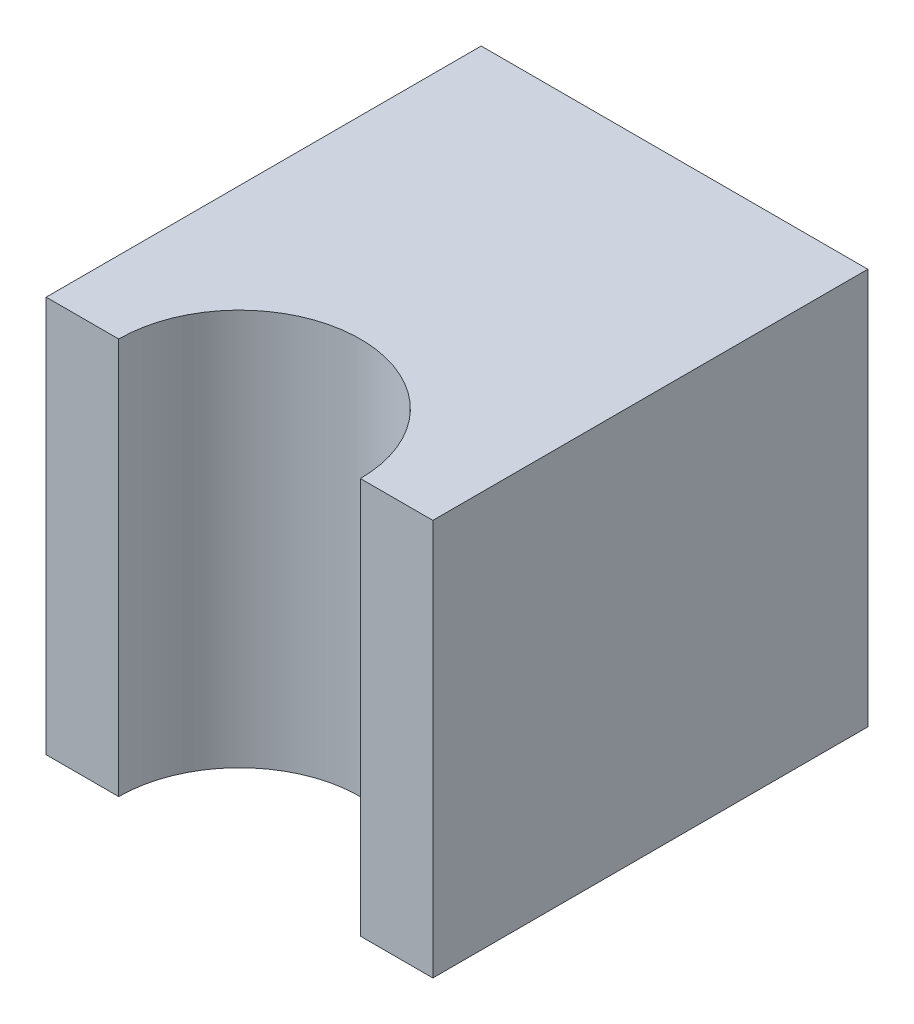
ISO-10303-21;
HEADER;
FILE_DESCRIPTION(('STEP AP214'),'2;1');
FILE_NAME('part.step','',(''),(''),'','','');
FILE_SCHEMA(('AUTOMOTIVE_DESIGN { 1 0 10303 214 1 1 1 1 }'));
ENDSEC;
DATA;
#1=APPLICATION_CONTEXT('core data for automotive mechanical design processes');
#2=APPLICATION_PROTOCOL_DEFINITION('international standard','automotive_design',2000,#1);
#3=PRODUCT_CONTEXT('',#1,'mechanical');
#4=PRODUCT('Part','Part','',(#3));
#5=PRODUCT_RELATED_PRODUCT_CATEGORY('part','',(#4));
#6=PRODUCT_DEFINITION_FORMATION('','',#4);
#7=PRODUCT_DEFINITION_CONTEXT('part definition',#1,'design');
#8=PRODUCT_DEFINITION('design','',#6,#7);
#9=PRODUCT_DEFINITION_SHAPE('','',#8);
#10=(LENGTH_UNIT() NAMED_UNIT(*) SI_UNIT(.MILLI.,.METRE.));
#11=(NAMED_UNIT(*) PLANE_ANGLE_UNIT() SI_UNIT($,.RADIAN.));
#12=(NAMED_UNIT(*) SI_UNIT($,.STERADIAN.) SOLID_ANGLE_UNIT());
#13=UNCERTAINTY_MEASURE_WITH_UNIT(LENGTH_MEASURE(1.E-05),#10,'distance_accuracy_value','');
#14=(GEOMETRIC_REPRESENTATION_CONTEXT(3) GLOBAL_UNCERTAINTY_ASSIGNED_CONTEXT((#13)) GLOBAL_UNIT_ASSIGNED_CONTEXT((#10,
#11,#12)) REPRESENTATION_CONTEXT('',''));
#15=CARTESIAN_POINT('',(0.,0.,0.));
#16=DIRECTION('',(0.,0.,1.));
#17=DIRECTION('',(1.,0.,0.));
#18=AXIS2_PLACEMENT_3D('',#15,#16,#17);
#19=CARTESIAN_POINT('',(7.,0.,6.1));
#20=DIRECTION('',(0.,1.,0.));
#21=DIRECTION('',(0.,0.,1.));
#22=AXIS2_PLACEMENT_3D('',#19,#20,#21);
#23=CYLINDRICAL_SURFACE('',#22,0.25);
#24=DIRECTION('',(0.,1.,0.));
#25=VECTOR('',#24,1.);
#26=CARTESIAN_POINT('',(7.25,0.,6.1));
#27=LINE('',#26,#25);
#28=CARTESIAN_POINT('',(7.25,0.82,6.1));
#29=VERTEX_POINT('',#28);
#30=CARTESIAN_POINT('',(7.25,0.,6.1));
#31=VERTEX_POINT('',#30);
#32=EDGE_CURVE('E125',#29,#31,#27,.F.);
#33=ORIENTED_EDGE('',*,*,#32,.F.);
#34=CARTESIAN_POINT('',(7.,0.82,6.1));
#35=DIRECTION('',(0.,1.,0.));
#36=DIRECTION('',(0.,0.,1.));
#37=AXIS2_PLACEMENT_3D('',#34,#35,#36);
#38=CIRCLE('',#37,0.25);
#39=CARTESIAN_POINT('',(6.75,0.82,6.1));
#40=VERTEX_POINT('',#39);
#41=EDGE_CURVE('E79',#40,#29,#38,.F.);
#42=ORIENTED_EDGE('',*,*,#41,.F.);
#43=DIRECTION('',(0.,1.,0.));
#44=VECTOR('',#43,1.);
#45=CARTESIAN_POINT('',(6.75,0.,6.1));
#46=LINE('',#45,#44);
#47=CARTESIAN_POINT('',(6.75,0.,6.1));
#48=VERTEX_POINT('',#47);
#49=EDGE_CURVE('E77',#48,#40,#46,.T.);
#50=ORIENTED_EDGE('',*,*,#49,.F.);
#51=CARTESIAN_POINT('',(7.,0.,6.1));
#52=DIRECTION('',(0.,1.,0.));
#53=DIRECTION('',(0.,0.,1.));
#54=AXIS2_PLACEMENT_3D('',#51,#52,#53);
#55=CIRCLE('',#54,0.25);
#56=EDGE_CURVE('E20',#48,#31,#55,.F.);
#57=ORIENTED_EDGE('',*,*,#56,.T.);
#58=EDGE_LOOP('',(#33,#42,#50,#57));
#59=FACE_BOUND('',#58,.T.);
#60=ADVANCED_FACE('F17',(#59),#23,.F.);
#61=CARTESIAN_POINT('',(7.25,0.,6.1));
#62=DIRECTION('',(0.,0.,1.));
#63=DIRECTION('',(1.,0.,0.));
#64=AXIS2_PLACEMENT_3D('',#61,#62,#63);
#65=PLANE('',#64);
#66=DIRECTION('',(1.,0.,0.));
#67=VECTOR('',#66,1.);
#68=CARTESIAN_POINT('',(7.075,0.82,6.1));
#69=LINE('',#68,#67);
#70=CARTESIAN_POINT('',(7.4,0.82,6.1));
#71=VERTEX_POINT('',#70);
#72=EDGE_CURVE('E101',#29,#71,#69,.T.);
#73=ORIENTED_EDGE('',*,*,#72,.F.);
#74=ORIENTED_EDGE('',*,*,#32,.T.);
#75=DIRECTION('',(1.,0.,0.));
#76=VECTOR('',#75,1.);
#77=CARTESIAN_POINT('',(7.075,0.,6.1));
#78=LINE('',#77,#76);
#79=CARTESIAN_POINT('',(7.4,0.,6.1));
#80=VERTEX_POINT('',#79);
#81=EDGE_CURVE('E73',#31,#80,#78,.T.);
#82=ORIENTED_EDGE('',*,*,#81,.T.);
#83=DIRECTION('',(0.,1.,0.));
#84=VECTOR('',#83,1.);
#85=CARTESIAN_POINT('',(7.4,0.,6.1));
#86=LINE('',#85,#84);
#87=EDGE_CURVE('E115',#71,#80,#86,.F.);
#88=ORIENTED_EDGE('',*,*,#87,.F.);
#89=EDGE_LOOP('',(#73,#74,#82,#88));
#90=FACE_BOUND('',#89,.T.);
#91=ADVANCED_FACE('F162',(#90),#65,.T.);
#92=CARTESIAN_POINT('',(7.4,0.,6.1));
#93=DIRECTION('',(1.,0.,0.));
#94=DIRECTION('',(0.,0.,-1.));
#95=AXIS2_PLACEMENT_3D('',#92,#93,#94);
#96=PLANE('',#95);
#97=DIRECTION('',(0.,0.,1.));
#98=VECTOR('',#97,1.);
#99=CARTESIAN_POINT('',(7.4,0.82,5.775));
#100=LINE('',#99,#98);
#101=CARTESIAN_POINT('',(7.4,0.82,5.2));
#102=VERTEX_POINT('',#101);
#103=EDGE_CURVE('E103',#71,#102,#100,.F.);
#104=ORIENTED_EDGE('',*,*,#103,.F.);
#105=ORIENTED_EDGE('',*,*,#87,.T.);
#106=DIRECTION('',(0.,0.,1.));
#107=VECTOR('',#106,1.);
#108=CARTESIAN_POINT('',(7.4,0.,5.775));
#109=LINE('',#108,#107);
#110=CARTESIAN_POINT('',(7.4,0.,5.2));
#111=VERTEX_POINT('',#110);
#112=EDGE_CURVE('E75',#80,#111,#109,.F.);
#113=ORIENTED_EDGE('',*,*,#112,.T.);
#114=DIRECTION('',(0.,1.,0.));
#115=VECTOR('',#114,1.);
#116=CARTESIAN_POINT('',(7.4,0.,5.2));
#117=LINE('',#116,#115);
#118=EDGE_CURVE('E96',#102,#111,#117,.F.);
#119=ORIENTED_EDGE('',*,*,#118,.F.);
#120=EDGE_LOOP('',(#104,#105,#113,#119));
#121=FACE_BOUND('',#120,.T.);
#122=ADVANCED_FACE('F132',(#121),#96,.T.);
#123=CARTESIAN_POINT('',(7.075,0.,5.775));
#124=DIRECTION('',(0.,1.,0.));
#125=DIRECTION('',(0.,0.,1.));
#126=AXIS2_PLACEMENT_3D('',#123,#124,#125);
#127=PLANE('',#126);
#128=DIRECTION('',(1.,0.,0.));
#129=VECTOR('',#128,1.);
#130=CARTESIAN_POINT('',(6.6,0.,6.1));
#131=LINE('',#130,#129);
#132=CARTESIAN_POINT('',(6.6,0.,6.1));
#133=VERTEX_POINT('',#132);
#134=EDGE_CURVE('E70',#133,#48,#131,.T.);
#135=ORIENTED_EDGE('',*,*,#134,.F.);
#136=DIRECTION('',(0.,0.,1.));
#137=VECTOR('',#136,1.);
#138=CARTESIAN_POINT('',(6.6,0.,5.2));
#139=LINE('',#138,#137);
#140=CARTESIAN_POINT('',(6.6,0.,5.2));
#141=VERTEX_POINT('',#140);
#142=EDGE_CURVE('E94',#141,#133,#139,.T.);
#143=ORIENTED_EDGE('',*,*,#142,.F.);
#144=DIRECTION('',(-1.,0.,0.));
#145=VECTOR('',#144,1.);
#146=CARTESIAN_POINT('',(7.4,0.,5.2));
#147=LINE('',#146,#145);
#148=EDGE_CURVE('E137',#111,#141,#147,.T.);
#149=ORIENTED_EDGE('',*,*,#148,.F.);
#150=ORIENTED_EDGE('',*,*,#112,.F.);
#151=ORIENTED_EDGE('',*,*,#81,.F.);
#152=ORIENTED_EDGE('',*,*,#56,.F.);
#153=EDGE_LOOP('',(#135,#143,#149,#150,#151,#152));
#154=FACE_BOUND('',#153,.T.);
#155=ADVANCED_FACE('F68',(#154),#127,.F.);
#156=CARTESIAN_POINT('',(6.6,0.,6.1));
#157=DIRECTION('',(0.,0.,1.));
#158=DIRECTION('',(1.,0.,0.));
#159=AXIS2_PLACEMENT_3D('',#156,#157,#158);
#160=PLANE('',#159);
#161=DIRECTION('',(1.,0.,0.));
#162=VECTOR('',#161,1.);
#163=CARTESIAN_POINT('',(7.075,0.82,6.1));
#164=LINE('',#163,#162);
#165=CARTESIAN_POINT('',(6.6,0.82,6.1));
#166=VERTEX_POINT('',#165);
#167=EDGE_CURVE('E106',#166,#40,#164,.T.);
#168=ORIENTED_EDGE('',*,*,#167,.F.);
#169=DIRECTION('',(0.,1.,0.));
#170=VECTOR('',#169,1.);
#171=CARTESIAN_POINT('',(6.6,0.,6.1));
#172=LINE('',#171,#170);
#173=EDGE_CURVE('E85',#133,#166,#172,.T.);
#174=ORIENTED_EDGE('',*,*,#173,.F.);
#175=ORIENTED_EDGE('',*,*,#134,.T.);
#176=ORIENTED_EDGE('',*,*,#49,.T.);
#177=EDGE_LOOP('',(#168,#174,#175,#176));
#178=FACE_BOUND('',#177,.T.);
#179=ADVANCED_FACE('F83',(#178),#160,.T.);
#180=CARTESIAN_POINT('',(7.075,0.82,5.775));
#181=DIRECTION('',(0.,1.,0.));
#182=DIRECTION('',(0.,0.,1.));
#183=AXIS2_PLACEMENT_3D('',#180,#181,#182);
#184=PLANE('',#183);
#185=DIRECTION('',(0.,0.,1.));
#186=VECTOR('',#185,1.);
#187=CARTESIAN_POINT('',(6.6,0.82,5.2));
#188=LINE('',#187,#186);
#189=CARTESIAN_POINT('',(6.6,0.82,5.2));
#190=VERTEX_POINT('',#189);
#191=EDGE_CURVE('E26',#166,#190,#188,.F.);
#192=ORIENTED_EDGE('',*,*,#191,.F.);
#193=ORIENTED_EDGE('',*,*,#167,.T.);
#194=ORIENTED_EDGE('',*,*,#41,.T.);
#195=ORIENTED_EDGE('',*,*,#72,.T.);
#196=ORIENTED_EDGE('',*,*,#103,.T.);
#197=DIRECTION('',(-1.,0.,0.));
#198=VECTOR('',#197,1.);
#199=CARTESIAN_POINT('',(7.4,0.82,5.2));
#200=LINE('',#199,#198);
#201=EDGE_CURVE('E35',#190,#102,#200,.F.);
#202=ORIENTED_EDGE('',*,*,#201,.F.);
#203=EDGE_LOOP('',(#192,#193,#194,#195,#196,#202));
#204=FACE_BOUND('',#203,.T.);
#205=ADVANCED_FACE('F144',(#204),#184,.T.);
#206=CARTESIAN_POINT('',(7.4,0.,5.2));
#207=DIRECTION('',(0.,0.,-1.));
#208=DIRECTION('',(-1.,0.,0.));
#209=AXIS2_PLACEMENT_3D('',#206,#207,#208);
#210=PLANE('',#209);
#211=ORIENTED_EDGE('',*,*,#201,.T.);
#212=ORIENTED_EDGE('',*,*,#118,.T.);
#213=ORIENTED_EDGE('',*,*,#148,.T.);
#214=DIRECTION('',(0.,1.,0.));
#215=VECTOR('',#214,1.);
#216=CARTESIAN_POINT('',(6.6,0.,5.2));
#217=LINE('',#216,#215);
#218=EDGE_CURVE('E11',#190,#141,#217,.F.);
#219=ORIENTED_EDGE('',*,*,#218,.F.);
#220=EDGE_LOOP('',(#211,#212,#213,#219));
#221=FACE_BOUND('',#220,.T.);
#222=ADVANCED_FACE('F141',(#221),#210,.T.);
#223=CARTESIAN_POINT('',(6.6,0.,5.2));
#224=DIRECTION('',(-1.,0.,0.));
#225=DIRECTION('',(0.,0.,1.));
#226=AXIS2_PLACEMENT_3D('',#223,#224,#225);
#227=PLANE('',#226);
#228=ORIENTED_EDGE('',*,*,#191,.T.);
#229=ORIENTED_EDGE('',*,*,#218,.T.);
#230=ORIENTED_EDGE('',*,*,#142,.T.);
#231=ORIENTED_EDGE('',*,*,#173,.T.);
#232=EDGE_LOOP('',(#228,#229,#230,#231));
#233=FACE_BOUND('',#232,.T.);
#234=ADVANCED_FACE('F146',(#233),#227,.T.);
#235=CLOSED_SHELL('',(#60,#91,#122,#155,#179,#205,#222,#234));
#236=MANIFOLD_SOLID_BREP('B1',#235);
#237=ADVANCED_BREP_SHAPE_REPRESENTATION('',(#18,#236),#14);
#238=SHAPE_DEFINITION_REPRESENTATION(#9,#237);
ENDSEC;
END-ISO-10303-21;
